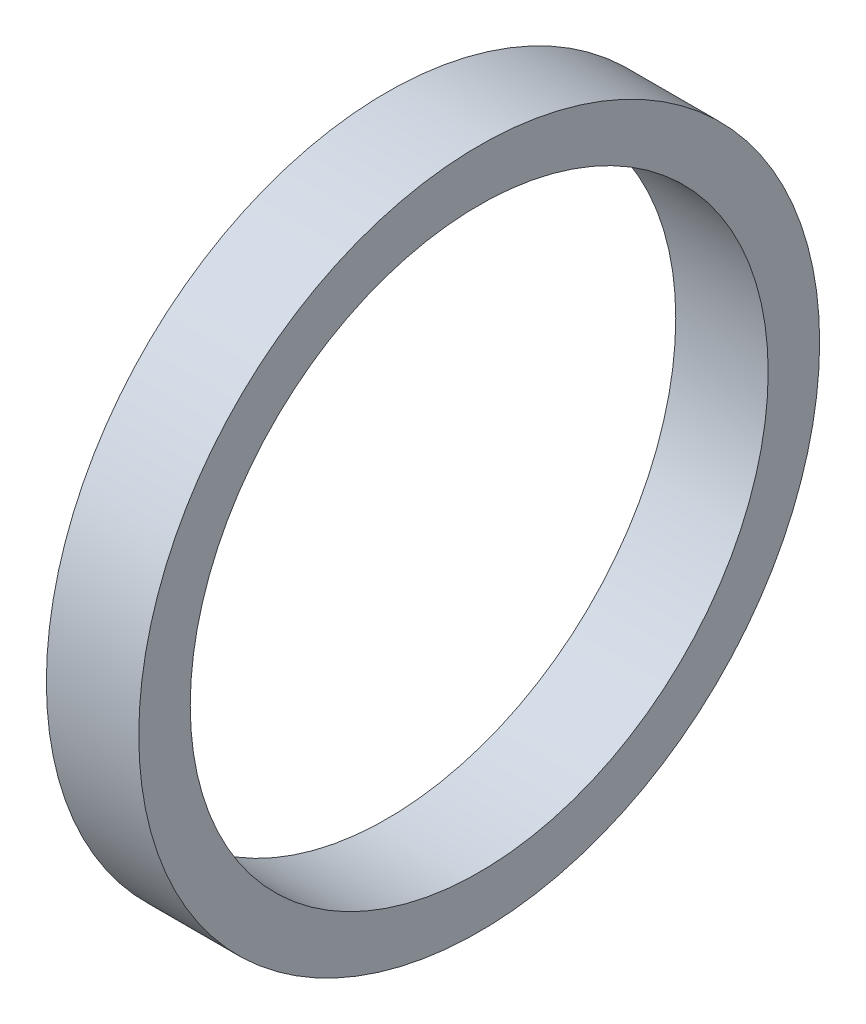
ISO-10303-21;
HEADER;
FILE_DESCRIPTION(('STEP AP214'),'2;1');
FILE_NAME('part.step','',(''),(''),'','','');
FILE_SCHEMA(('AUTOMOTIVE_DESIGN { 1 0 10303 214 1 1 1 1 }'));
ENDSEC;
DATA;
#1=APPLICATION_CONTEXT('core data for automotive mechanical design processes');
#2=APPLICATION_PROTOCOL_DEFINITION('international standard','automotive_design',2000,#1);
#3=PRODUCT_CONTEXT('',#1,'mechanical');
#4=PRODUCT('Part','Part','',(#3));
#5=PRODUCT_RELATED_PRODUCT_CATEGORY('part','',(#4));
#6=PRODUCT_DEFINITION_FORMATION('','',#4);
#7=PRODUCT_DEFINITION_CONTEXT('part definition',#1,'design');
#8=PRODUCT_DEFINITION('design','',#6,#7);
#9=PRODUCT_DEFINITION_SHAPE('','',#8);
#10=(LENGTH_UNIT() NAMED_UNIT(*) SI_UNIT(.MILLI.,.METRE.));
#11=(NAMED_UNIT(*) PLANE_ANGLE_UNIT() SI_UNIT($,.RADIAN.));
#12=(NAMED_UNIT(*) SI_UNIT($,.STERADIAN.) SOLID_ANGLE_UNIT());
#13=UNCERTAINTY_MEASURE_WITH_UNIT(LENGTH_MEASURE(1.E-05),#10,'distance_accuracy_value','');
#14=(GEOMETRIC_REPRESENTATION_CONTEXT(3) GLOBAL_UNCERTAINTY_ASSIGNED_CONTEXT((#13)) GLOBAL_UNIT_ASSIGNED_CONTEXT((#10,
#11,#12)) REPRESENTATION_CONTEXT('',''));
#15=CARTESIAN_POINT('',(0.,0.,0.));
#16=DIRECTION('',(0.,0.,1.));
#17=DIRECTION('',(1.,0.,0.));
#18=AXIS2_PLACEMENT_3D('',#15,#16,#17);
#19=CARTESIAN_POINT('',(25.716228569532,0.,0.));
#20=DIRECTION('',(1.,0.,0.));
#21=DIRECTION('',(0.,0.,-1.));
#22=AXIS2_PLACEMENT_3D('',#19,#20,#21);
#23=CYLINDRICAL_SURFACE('',#22,21.000000037);
#24=CARTESIAN_POINT('',(-73.61250008,0.,0.));
#25=DIRECTION('',(1.,0.,0.));
#26=DIRECTION('',(0.,0.,-1.));
#27=AXIS2_PLACEMENT_3D('',#24,#25,#26);
#28=CIRCLE('',#27,21.000000037);
#29=CARTESIAN_POINT('',(-73.61250008,0.,-21.000000037));
#30=VERTEX_POINT('',#29);
#31=EDGE_CURVE('E10',#30,#30,#28,.T.);
#32=ORIENTED_EDGE('',*,*,#31,.T.);
#33=EDGE_LOOP('',(#32));
#34=FACE_BOUND('',#33,.T.);
#35=CARTESIAN_POINT('',(-67.91250008,0.,0.));
#36=DIRECTION('',(1.,0.,0.));
#37=DIRECTION('',(0.,0.,-1.));
#38=AXIS2_PLACEMENT_3D('',#35,#36,#37);
#39=CIRCLE('',#38,21.000000037);
#40=CARTESIAN_POINT('',(-67.91250008,0.,-21.000000037));
#41=VERTEX_POINT('',#40);
#42=EDGE_CURVE('E47',#41,#41,#39,.T.);
#43=ORIENTED_EDGE('',*,*,#42,.F.);
#44=EDGE_LOOP('',(#43));
#45=FACE_BOUND('',#44,.T.);
#46=ADVANCED_FACE('F33',(#34,#45),#23,.T.);
#47=CARTESIAN_POINT('',(-73.61250008,0.,0.));
#48=DIRECTION('',(-1.,0.,0.));
#49=DIRECTION('',(0.,0.,1.));
#50=AXIS2_PLACEMENT_3D('',#47,#48,#49);
#51=PLANE('',#50);
#52=CARTESIAN_POINT('',(-73.61250008,0.,0.));
#53=DIRECTION('',(1.,0.,0.));
#54=DIRECTION('',(0.,0.,-1.));
#55=AXIS2_PLACEMENT_3D('',#52,#53,#54);
#56=CIRCLE('',#55,17.825000037);
#57=CARTESIAN_POINT('',(-73.61250008,0.,-17.825000037));
#58=VERTEX_POINT('',#57);
#59=EDGE_CURVE('E39',#58,#58,#56,.T.);
#60=ORIENTED_EDGE('',*,*,#59,.T.);
#61=EDGE_LOOP('',(#60));
#62=FACE_BOUND('',#61,.T.);
#63=ORIENTED_EDGE('',*,*,#31,.F.);
#64=EDGE_LOOP('',(#63));
#65=FACE_BOUND('',#64,.T.);
#66=ADVANCED_FACE('F56',(#62,#65),#51,.T.);
#67=CARTESIAN_POINT('',(25.716228569532,0.,0.));
#68=DIRECTION('',(1.,0.,0.));
#69=DIRECTION('',(0.,0.,-1.));
#70=AXIS2_PLACEMENT_3D('',#67,#68,#69);
#71=CYLINDRICAL_SURFACE('',#70,17.825000037);
#72=ORIENTED_EDGE('',*,*,#59,.F.);
#73=EDGE_LOOP('',(#72));
#74=FACE_BOUND('',#73,.T.);
#75=CARTESIAN_POINT('',(-67.91250008,0.,0.));
#76=DIRECTION('',(1.,0.,0.));
#77=DIRECTION('',(0.,0.,-1.));
#78=AXIS2_PLACEMENT_3D('',#75,#76,#77);
#79=CIRCLE('',#78,17.825000037);
#80=CARTESIAN_POINT('',(-67.91250008,0.,-17.825000037));
#81=VERTEX_POINT('',#80);
#82=EDGE_CURVE('E43',#81,#81,#79,.T.);
#83=ORIENTED_EDGE('',*,*,#82,.T.);
#84=EDGE_LOOP('',(#83));
#85=FACE_BOUND('',#84,.T.);
#86=ADVANCED_FACE('F60',(#74,#85),#71,.F.);
#87=CARTESIAN_POINT('',(-67.91250008,0.,0.));
#88=DIRECTION('',(-1.,0.,0.));
#89=DIRECTION('',(0.,0.,1.));
#90=AXIS2_PLACEMENT_3D('',#87,#88,#89);
#91=PLANE('',#90);
#92=ORIENTED_EDGE('',*,*,#82,.F.);
#93=EDGE_LOOP('',(#92));
#94=FACE_BOUND('',#93,.T.);
#95=ORIENTED_EDGE('',*,*,#42,.T.);
#96=EDGE_LOOP('',(#95));
#97=FACE_BOUND('',#96,.T.);
#98=ADVANCED_FACE('F53',(#94,#97),#91,.F.);
#99=CLOSED_SHELL('',(#46,#66,#86,#98));
#100=MANIFOLD_SOLID_BREP('B2',#99);
#101=ADVANCED_BREP_SHAPE_REPRESENTATION('',(#18,#100),#14);
#102=SHAPE_DEFINITION_REPRESENTATION(#9,#101);
ENDSEC;
END-ISO-10303-21;
